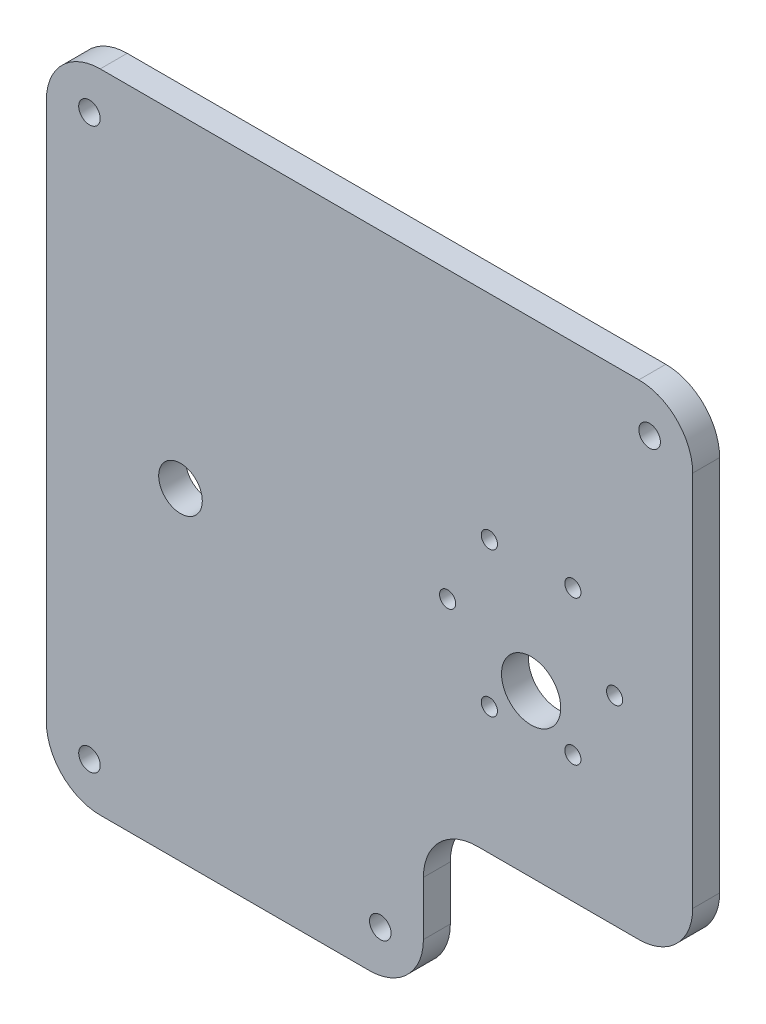
ISO-10303-21;
HEADER;
FILE_DESCRIPTION(('STEP AP214'),'2;1');
FILE_NAME('part.step','',(''),(''),'','','');
FILE_SCHEMA(('AUTOMOTIVE_DESIGN { 1 0 10303 214 1 1 1 1 }'));
ENDSEC;
DATA;
#1=APPLICATION_CONTEXT('core data for automotive mechanical design processes');
#2=APPLICATION_PROTOCOL_DEFINITION('international standard','automotive_design',2000,#1);
#3=PRODUCT_CONTEXT('',#1,'mechanical');
#4=PRODUCT('Part','Part','',(#3));
#5=PRODUCT_RELATED_PRODUCT_CATEGORY('part','',(#4));
#6=PRODUCT_DEFINITION_FORMATION('','',#4);
#7=PRODUCT_DEFINITION_CONTEXT('part definition',#1,'design');
#8=PRODUCT_DEFINITION('design','',#6,#7);
#9=PRODUCT_DEFINITION_SHAPE('','',#8);
#10=(LENGTH_UNIT() NAMED_UNIT(*) SI_UNIT(.MILLI.,.METRE.));
#11=(NAMED_UNIT(*) PLANE_ANGLE_UNIT() SI_UNIT($,.RADIAN.));
#12=(NAMED_UNIT(*) SI_UNIT($,.STERADIAN.) SOLID_ANGLE_UNIT());
#13=UNCERTAINTY_MEASURE_WITH_UNIT(LENGTH_MEASURE(1.E-05),#10,'distance_accuracy_value','');
#14=(GEOMETRIC_REPRESENTATION_CONTEXT(3) GLOBAL_UNCERTAINTY_ASSIGNED_CONTEXT((#13)) GLOBAL_UNIT_ASSIGNED_CONTEXT((#10,
#11,#12)) REPRESENTATION_CONTEXT('',''));
#15=CARTESIAN_POINT('',(0.,0.,0.));
#16=DIRECTION('',(0.,0.,1.));
#17=DIRECTION('',(1.,0.,0.));
#18=AXIS2_PLACEMENT_3D('',#15,#16,#17);
#19=CARTESIAN_POINT('',(60.,10.,5.));
#20=DIRECTION('',(0.,0.,-1.));
#21=DIRECTION('',(-1.,0.,0.));
#22=AXIS2_PLACEMENT_3D('',#19,#20,#21);
#23=CYLINDRICAL_SURFACE('',#22,10.);
#24=CARTESIAN_POINT('',(60.,10.,0.));
#25=DIRECTION('',(0.,0.,1.));
#26=DIRECTION('',(-1.,0.,0.));
#27=AXIS2_PLACEMENT_3D('',#24,#25,#26);
#28=CIRCLE('',#27,10.);
#29=CARTESIAN_POINT('',(59.9999999999999,0.,0.));
#30=VERTEX_POINT('',#29);
#31=CARTESIAN_POINT('',(70.,10.0000000000001,0.));
#32=VERTEX_POINT('',#31);
#33=EDGE_CURVE('E156',#30,#32,#28,.T.);
#34=ORIENTED_EDGE('',*,*,#33,.T.);
#35=DIRECTION('',(0.,0.,-1.));
#36=VECTOR('',#35,1.);
#37=CARTESIAN_POINT('',(70.,10.0000000000001,5.));
#38=LINE('',#37,#36);
#39=CARTESIAN_POINT('',(70.,10.0000000000001,5.));
#40=VERTEX_POINT('',#39);
#41=EDGE_CURVE('E11',#40,#32,#38,.T.);
#42=ORIENTED_EDGE('',*,*,#41,.F.);
#43=CARTESIAN_POINT('',(60.,10.,5.));
#44=DIRECTION('',(0.,0.,1.));
#45=DIRECTION('',(-1.,0.,0.));
#46=AXIS2_PLACEMENT_3D('',#43,#44,#45);
#47=CIRCLE('',#46,10.);
#48=CARTESIAN_POINT('',(59.9999999999999,0.,5.));
#49=VERTEX_POINT('',#48);
#50=EDGE_CURVE('E179',#49,#40,#47,.T.);
#51=ORIENTED_EDGE('',*,*,#50,.F.);
#52=DIRECTION('',(0.,0.,-1.));
#53=VECTOR('',#52,1.);
#54=CARTESIAN_POINT('',(59.9999999999999,0.,5.));
#55=LINE('',#54,#53);
#56=EDGE_CURVE('E152',#49,#30,#55,.T.);
#57=ORIENTED_EDGE('',*,*,#56,.T.);
#58=EDGE_LOOP('',(#34,#42,#51,#57));
#59=FACE_BOUND('',#58,.T.);
#60=ADVANCED_FACE('F34',(#59),#23,.T.);
#61=CARTESIAN_POINT('',(70.,19.9999999999999,5.));
#62=DIRECTION('',(-1.,0.,0.));
#63=DIRECTION('',(0.,0.,1.));
#64=AXIS2_PLACEMENT_3D('',#61,#62,#63);
#65=PLANE('',#64);
#66=DIRECTION('',(0.,1.,0.));
#67=VECTOR('',#66,1.);
#68=CARTESIAN_POINT('',(70.,19.9999999999999,0.));
#69=LINE('',#68,#67);
#70=CARTESIAN_POINT('',(70.,19.9999999999999,0.));
#71=VERTEX_POINT('',#70);
#72=EDGE_CURVE('E159',#32,#71,#69,.T.);
#73=ORIENTED_EDGE('',*,*,#72,.T.);
#74=DIRECTION('',(0.,0.,-1.));
#75=VECTOR('',#74,1.);
#76=CARTESIAN_POINT('',(70.,19.9999999999999,5.));
#77=LINE('',#76,#75);
#78=CARTESIAN_POINT('',(70.,19.9999999999999,5.));
#79=VERTEX_POINT('',#78);
#80=EDGE_CURVE('E43',#79,#71,#77,.T.);
#81=ORIENTED_EDGE('',*,*,#80,.F.);
#82=DIRECTION('',(0.,1.,0.));
#83=VECTOR('',#82,1.);
#84=CARTESIAN_POINT('',(70.,19.9999999999999,5.));
#85=LINE('',#84,#83);
#86=EDGE_CURVE('E107',#40,#79,#85,.T.);
#87=ORIENTED_EDGE('',*,*,#86,.F.);
#88=ORIENTED_EDGE('',*,*,#41,.T.);
#89=EDGE_LOOP('',(#73,#81,#87,#88));
#90=FACE_BOUND('',#89,.T.);
#91=ADVANCED_FACE('F290',(#90),#65,.F.);
#92=CARTESIAN_POINT('',(80.,20.,5.));
#93=DIRECTION('',(0.,0.,-1.));
#94=DIRECTION('',(-1.,0.,0.));
#95=AXIS2_PLACEMENT_3D('',#92,#93,#94);
#96=CYLINDRICAL_SURFACE('',#95,10.);
#97=CARTESIAN_POINT('',(80.,20.,0.));
#98=DIRECTION('',(0.,0.,-1.));
#99=DIRECTION('',(1.,0.,0.));
#100=AXIS2_PLACEMENT_3D('',#97,#98,#99);
#101=CIRCLE('',#100,10.);
#102=CARTESIAN_POINT('',(80.0000000000001,30.,0.));
#103=VERTEX_POINT('',#102);
#104=EDGE_CURVE('E162',#71,#103,#101,.T.);
#105=ORIENTED_EDGE('',*,*,#104,.T.);
#106=DIRECTION('',(0.,0.,-1.));
#107=VECTOR('',#106,1.);
#108=CARTESIAN_POINT('',(80.0000000000001,30.,5.));
#109=LINE('',#108,#107);
#110=CARTESIAN_POINT('',(80.0000000000001,30.,5.));
#111=VERTEX_POINT('',#110);
#112=EDGE_CURVE('E198',#111,#103,#109,.T.);
#113=ORIENTED_EDGE('',*,*,#112,.F.);
#114=CARTESIAN_POINT('',(80.,20.,5.));
#115=DIRECTION('',(0.,0.,-1.));
#116=DIRECTION('',(1.,0.,0.));
#117=AXIS2_PLACEMENT_3D('',#114,#115,#116);
#118=CIRCLE('',#117,10.);
#119=EDGE_CURVE('E250',#79,#111,#118,.T.);
#120=ORIENTED_EDGE('',*,*,#119,.F.);
#121=ORIENTED_EDGE('',*,*,#80,.T.);
#122=EDGE_LOOP('',(#105,#113,#120,#121));
#123=FACE_BOUND('',#122,.T.);
#124=ADVANCED_FACE('F294',(#123),#96,.F.);
#125=CARTESIAN_POINT('',(110.,30.,5.));
#126=DIRECTION('',(0.,1.,0.));
#127=DIRECTION('',(-1.,0.,0.));
#128=AXIS2_PLACEMENT_3D('',#125,#126,#127);
#129=PLANE('',#128);
#130=DIRECTION('',(1.,0.,0.));
#131=VECTOR('',#130,1.);
#132=CARTESIAN_POINT('',(110.,30.,0.));
#133=LINE('',#132,#131);
#134=CARTESIAN_POINT('',(110.,30.,0.));
#135=VERTEX_POINT('',#134);
#136=EDGE_CURVE('E164',#103,#135,#133,.T.);
#137=ORIENTED_EDGE('',*,*,#136,.T.);
#138=DIRECTION('',(0.,0.,-1.));
#139=VECTOR('',#138,1.);
#140=CARTESIAN_POINT('',(110.,30.,5.));
#141=LINE('',#140,#139);
#142=CARTESIAN_POINT('',(110.,30.,5.));
#143=VERTEX_POINT('',#142);
#144=EDGE_CURVE('E195',#143,#135,#141,.T.);
#145=ORIENTED_EDGE('',*,*,#144,.F.);
#146=DIRECTION('',(1.,0.,0.));
#147=VECTOR('',#146,1.);
#148=CARTESIAN_POINT('',(110.,30.,5.));
#149=LINE('',#148,#147);
#150=EDGE_CURVE('E252',#111,#143,#149,.T.);
#151=ORIENTED_EDGE('',*,*,#150,.F.);
#152=ORIENTED_EDGE('',*,*,#112,.T.);
#153=EDGE_LOOP('',(#137,#145,#151,#152));
#154=FACE_BOUND('',#153,.T.);
#155=ADVANCED_FACE('F298',(#154),#129,.F.);
#156=CARTESIAN_POINT('',(110.,40.,5.));
#157=DIRECTION('',(0.,0.,-1.));
#158=DIRECTION('',(-1.,0.,0.));
#159=AXIS2_PLACEMENT_3D('',#156,#157,#158);
#160=CYLINDRICAL_SURFACE('',#159,10.);
#161=CARTESIAN_POINT('',(110.,40.,0.));
#162=DIRECTION('',(0.,0.,1.));
#163=DIRECTION('',(1.,0.,0.));
#164=AXIS2_PLACEMENT_3D('',#161,#162,#163);
#165=CIRCLE('',#164,10.);
#166=CARTESIAN_POINT('',(120.,40.,0.));
#167=VERTEX_POINT('',#166);
#168=EDGE_CURVE('E166',#135,#167,#165,.T.);
#169=ORIENTED_EDGE('',*,*,#168,.T.);
#170=DIRECTION('',(0.,0.,-1.));
#171=VECTOR('',#170,1.);
#172=CARTESIAN_POINT('',(120.,40.,5.));
#173=LINE('',#172,#171);
#174=CARTESIAN_POINT('',(120.,40.,5.));
#175=VERTEX_POINT('',#174);
#176=EDGE_CURVE('E192',#175,#167,#173,.T.);
#177=ORIENTED_EDGE('',*,*,#176,.F.);
#178=CARTESIAN_POINT('',(110.,40.,5.));
#179=DIRECTION('',(0.,0.,1.));
#180=DIRECTION('',(1.,0.,0.));
#181=AXIS2_PLACEMENT_3D('',#178,#179,#180);
#182=CIRCLE('',#181,10.);
#183=EDGE_CURVE('E254',#143,#175,#182,.T.);
#184=ORIENTED_EDGE('',*,*,#183,.F.);
#185=ORIENTED_EDGE('',*,*,#144,.T.);
#186=EDGE_LOOP('',(#169,#177,#184,#185));
#187=FACE_BOUND('',#186,.T.);
#188=ADVANCED_FACE('F304',(#187),#160,.T.);
#189=CARTESIAN_POINT('',(120.,40.0000000000001,5.));
#190=DIRECTION('',(-1.,0.,0.));
#191=DIRECTION('',(0.,0.,1.));
#192=AXIS2_PLACEMENT_3D('',#189,#190,#191);
#193=PLANE('',#192);
#194=DIRECTION('',(0.,1.,0.));
#195=VECTOR('',#194,1.);
#196=CARTESIAN_POINT('',(120.,40.0000000000001,0.));
#197=LINE('',#196,#195);
#198=CARTESIAN_POINT('',(120.,110.,0.));
#199=VERTEX_POINT('',#198);
#200=EDGE_CURVE('E168',#167,#199,#197,.T.);
#201=ORIENTED_EDGE('',*,*,#200,.T.);
#202=DIRECTION('',(0.,0.,-1.));
#203=VECTOR('',#202,1.);
#204=CARTESIAN_POINT('',(120.,110.,5.));
#205=LINE('',#204,#203);
#206=CARTESIAN_POINT('',(120.,110.,5.));
#207=VERTEX_POINT('',#206);
#208=EDGE_CURVE('E189',#207,#199,#205,.T.);
#209=ORIENTED_EDGE('',*,*,#208,.F.);
#210=DIRECTION('',(0.,1.,0.));
#211=VECTOR('',#210,1.);
#212=CARTESIAN_POINT('',(120.,40.0000000000001,5.));
#213=LINE('',#212,#211);
#214=EDGE_CURVE('E256',#175,#207,#213,.T.);
#215=ORIENTED_EDGE('',*,*,#214,.F.);
#216=ORIENTED_EDGE('',*,*,#176,.T.);
#217=EDGE_LOOP('',(#201,#209,#215,#216));
#218=FACE_BOUND('',#217,.T.);
#219=ADVANCED_FACE('F308',(#218),#193,.F.);
#220=CARTESIAN_POINT('',(110.,110.,5.));
#221=DIRECTION('',(0.,0.,-1.));
#222=DIRECTION('',(-1.,0.,0.));
#223=AXIS2_PLACEMENT_3D('',#220,#221,#222);
#224=CYLINDRICAL_SURFACE('',#223,9.99999999999999);
#225=CARTESIAN_POINT('',(110.,110.,0.));
#226=DIRECTION('',(0.,0.,1.));
#227=DIRECTION('',(-1.,0.,0.));
#228=AXIS2_PLACEMENT_3D('',#225,#226,#227);
#229=CIRCLE('',#228,9.99999999999999);
#230=CARTESIAN_POINT('',(110.,120.,0.));
#231=VERTEX_POINT('',#230);
#232=EDGE_CURVE('E170',#199,#231,#229,.T.);
#233=ORIENTED_EDGE('',*,*,#232,.T.);
#234=DIRECTION('',(0.,0.,-1.));
#235=VECTOR('',#234,1.);
#236=CARTESIAN_POINT('',(110.,120.,5.));
#237=LINE('',#236,#235);
#238=CARTESIAN_POINT('',(110.,120.,5.));
#239=VERTEX_POINT('',#238);
#240=EDGE_CURVE('E186',#239,#231,#237,.T.);
#241=ORIENTED_EDGE('',*,*,#240,.F.);
#242=CARTESIAN_POINT('',(110.,110.,5.));
#243=DIRECTION('',(0.,0.,1.));
#244=DIRECTION('',(-1.,0.,0.));
#245=AXIS2_PLACEMENT_3D('',#242,#243,#244);
#246=CIRCLE('',#245,9.99999999999999);
#247=EDGE_CURVE('E258',#207,#239,#246,.T.);
#248=ORIENTED_EDGE('',*,*,#247,.F.);
#249=ORIENTED_EDGE('',*,*,#208,.T.);
#250=EDGE_LOOP('',(#233,#241,#248,#249));
#251=FACE_BOUND('',#250,.T.);
#252=ADVANCED_FACE('F312',(#251),#224,.T.);
#253=CARTESIAN_POINT('',(10.0000000000001,120.,5.));
#254=DIRECTION('',(0.,-1.,0.));
#255=DIRECTION('',(0.,0.,-1.));
#256=AXIS2_PLACEMENT_3D('',#253,#254,#255);
#257=PLANE('',#256);
#258=DIRECTION('',(-1.,0.,0.));
#259=VECTOR('',#258,1.);
#260=CARTESIAN_POINT('',(10.0000000000001,120.,0.));
#261=LINE('',#260,#259);
#262=CARTESIAN_POINT('',(10.0000000000001,120.,0.));
#263=VERTEX_POINT('',#262);
#264=EDGE_CURVE('E172',#231,#263,#261,.T.);
#265=ORIENTED_EDGE('',*,*,#264,.T.);
#266=DIRECTION('',(0.,0.,-1.));
#267=VECTOR('',#266,1.);
#268=CARTESIAN_POINT('',(10.0000000000001,120.,5.));
#269=LINE('',#268,#267);
#270=CARTESIAN_POINT('',(10.0000000000001,120.,5.));
#271=VERTEX_POINT('',#270);
#272=EDGE_CURVE('E183',#271,#263,#269,.T.);
#273=ORIENTED_EDGE('',*,*,#272,.F.);
#274=DIRECTION('',(-1.,0.,0.));
#275=VECTOR('',#274,1.);
#276=CARTESIAN_POINT('',(10.0000000000001,120.,5.));
#277=LINE('',#276,#275);
#278=EDGE_CURVE('E260',#239,#271,#277,.T.);
#279=ORIENTED_EDGE('',*,*,#278,.F.);
#280=ORIENTED_EDGE('',*,*,#240,.T.);
#281=EDGE_LOOP('',(#265,#273,#279,#280));
#282=FACE_BOUND('',#281,.T.);
#283=ADVANCED_FACE('F266',(#282),#257,.F.);
#284=CARTESIAN_POINT('',(10.,110.,5.));
#285=DIRECTION('',(0.,0.,-1.));
#286=DIRECTION('',(-1.,0.,0.));
#287=AXIS2_PLACEMENT_3D('',#284,#285,#286);
#288=CYLINDRICAL_SURFACE('',#287,10.);
#289=CARTESIAN_POINT('',(10.,110.,0.));
#290=DIRECTION('',(0.,0.,1.));
#291=DIRECTION('',(-1.,0.,0.));
#292=AXIS2_PLACEMENT_3D('',#289,#290,#291);
#293=CIRCLE('',#292,10.);
#294=CARTESIAN_POINT('',(0.,110.,0.));
#295=VERTEX_POINT('',#294);
#296=EDGE_CURVE('E174',#263,#295,#293,.T.);
#297=ORIENTED_EDGE('',*,*,#296,.T.);
#298=DIRECTION('',(0.,0.,-1.));
#299=VECTOR('',#298,1.);
#300=CARTESIAN_POINT('',(0.,110.,5.));
#301=LINE('',#300,#299);
#302=CARTESIAN_POINT('',(0.,110.,5.));
#303=VERTEX_POINT('',#302);
#304=EDGE_CURVE('E147',#303,#295,#301,.T.);
#305=ORIENTED_EDGE('',*,*,#304,.F.);
#306=CARTESIAN_POINT('',(10.,110.,5.));
#307=DIRECTION('',(0.,0.,1.));
#308=DIRECTION('',(-1.,0.,0.));
#309=AXIS2_PLACEMENT_3D('',#306,#307,#308);
#310=CIRCLE('',#309,10.);
#311=EDGE_CURVE('E138',#271,#303,#310,.T.);
#312=ORIENTED_EDGE('',*,*,#311,.F.);
#313=ORIENTED_EDGE('',*,*,#272,.T.);
#314=EDGE_LOOP('',(#297,#305,#312,#313));
#315=FACE_BOUND('',#314,.T.);
#316=ADVANCED_FACE('F270',(#315),#288,.T.);
#317=CARTESIAN_POINT('',(0.,10.0000000000001,5.));
#318=DIRECTION('',(1.,0.,0.));
#319=DIRECTION('',(0.,0.,-1.));
#320=AXIS2_PLACEMENT_3D('',#317,#318,#319);
#321=PLANE('',#320);
#322=DIRECTION('',(0.,-1.,0.));
#323=VECTOR('',#322,1.);
#324=CARTESIAN_POINT('',(0.,10.0000000000001,0.));
#325=LINE('',#324,#323);
#326=CARTESIAN_POINT('',(0.,10.0000000000001,0.));
#327=VERTEX_POINT('',#326);
#328=EDGE_CURVE('E146',#295,#327,#325,.T.);
#329=ORIENTED_EDGE('',*,*,#328,.T.);
#330=DIRECTION('',(0.,0.,-1.));
#331=VECTOR('',#330,1.);
#332=CARTESIAN_POINT('',(0.,10.0000000000001,5.));
#333=LINE('',#332,#331);
#334=CARTESIAN_POINT('',(0.,10.0000000000001,5.));
#335=VERTEX_POINT('',#334);
#336=EDGE_CURVE('E143',#335,#327,#333,.T.);
#337=ORIENTED_EDGE('',*,*,#336,.F.);
#338=DIRECTION('',(0.,-1.,0.));
#339=VECTOR('',#338,1.);
#340=CARTESIAN_POINT('',(0.,10.0000000000001,5.));
#341=LINE('',#340,#339);
#342=EDGE_CURVE('E132',#303,#335,#341,.T.);
#343=ORIENTED_EDGE('',*,*,#342,.F.);
#344=ORIENTED_EDGE('',*,*,#304,.T.);
#345=EDGE_LOOP('',(#329,#337,#343,#344));
#346=FACE_BOUND('',#345,.T.);
#347=ADVANCED_FACE('F144',(#346),#321,.F.);
#348=CARTESIAN_POINT('',(10.,10.,5.));
#349=DIRECTION('',(0.,0.,-1.));
#350=DIRECTION('',(-1.,0.,0.));
#351=AXIS2_PLACEMENT_3D('',#348,#349,#350);
#352=CYLINDRICAL_SURFACE('',#351,10.);
#353=CARTESIAN_POINT('',(10.,10.,0.));
#354=DIRECTION('',(0.,0.,1.));
#355=DIRECTION('',(-1.,0.,0.));
#356=AXIS2_PLACEMENT_3D('',#353,#354,#355);
#357=CIRCLE('',#356,10.);
#358=CARTESIAN_POINT('',(10.0000000000001,0.,0.));
#359=VERTEX_POINT('',#358);
#360=EDGE_CURVE('E93',#327,#359,#357,.T.);
#361=ORIENTED_EDGE('',*,*,#360,.T.);
#362=DIRECTION('',(0.,0.,-1.));
#363=VECTOR('',#362,1.);
#364=CARTESIAN_POINT('',(10.0000000000001,0.,5.));
#365=LINE('',#364,#363);
#366=CARTESIAN_POINT('',(10.0000000000001,0.,5.));
#367=VERTEX_POINT('',#366);
#368=EDGE_CURVE('E148',#367,#359,#365,.T.);
#369=ORIENTED_EDGE('',*,*,#368,.F.);
#370=CARTESIAN_POINT('',(10.,10.,5.));
#371=DIRECTION('',(0.,0.,1.));
#372=DIRECTION('',(-1.,0.,0.));
#373=AXIS2_PLACEMENT_3D('',#370,#371,#372);
#374=CIRCLE('',#373,10.);
#375=EDGE_CURVE('E136',#335,#367,#374,.T.);
#376=ORIENTED_EDGE('',*,*,#375,.F.);
#377=ORIENTED_EDGE('',*,*,#336,.T.);
#378=EDGE_LOOP('',(#361,#369,#376,#377));
#379=FACE_BOUND('',#378,.T.);
#380=ADVANCED_FACE('F150',(#379),#352,.T.);
#381=CARTESIAN_POINT('',(10.0000000000001,0.,5.));
#382=DIRECTION('',(0.,1.,0.));
#383=DIRECTION('',(-1.,0.,0.));
#384=AXIS2_PLACEMENT_3D('',#381,#382,#383);
#385=PLANE('',#384);
#386=DIRECTION('',(1.,0.,0.));
#387=VECTOR('',#386,1.);
#388=CARTESIAN_POINT('',(10.0000000000001,0.,0.));
#389=LINE('',#388,#387);
#390=EDGE_CURVE('E99',#359,#30,#389,.T.);
#391=ORIENTED_EDGE('',*,*,#390,.T.);
#392=ORIENTED_EDGE('',*,*,#56,.F.);
#393=DIRECTION('',(1.,0.,0.));
#394=VECTOR('',#393,1.);
#395=CARTESIAN_POINT('',(10.0000000000001,0.,5.));
#396=LINE('',#395,#394);
#397=EDGE_CURVE('E52',#367,#49,#396,.T.);
#398=ORIENTED_EDGE('',*,*,#397,.F.);
#399=ORIENTED_EDGE('',*,*,#368,.T.);
#400=EDGE_LOOP('',(#391,#392,#398,#399));
#401=FACE_BOUND('',#400,.T.);
#402=ADVANCED_FACE('F278',(#401),#385,.F.);
#403=CARTESIAN_POINT('',(60.,10.,5.));
#404=DIRECTION('',(0.,0.,-1.));
#405=DIRECTION('',(-1.,0.,0.));
#406=AXIS2_PLACEMENT_3D('',#403,#404,#405);
#407=PLANE('',#406);
#408=CARTESIAN_POINT('',(82.25,53.5766062413412,5.));
#409=DIRECTION('',(0.,0.,1.));
#410=DIRECTION('',(1.,0.,0.));
#411=AXIS2_PLACEMENT_3D('',#408,#409,#410);
#412=CIRCLE('',#411,1.5);
#413=CARTESIAN_POINT('',(83.75,53.5766062413412,5.));
#414=VERTEX_POINT('',#413);
#415=EDGE_CURVE('E473',#414,#414,#412,.T.);
#416=ORIENTED_EDGE('',*,*,#415,.F.);
#417=EDGE_LOOP('',(#416));
#418=FACE_BOUND('',#417,.T.);
#419=CARTESIAN_POINT('',(74.5,67.,5.));
#420=DIRECTION('',(0.,0.,1.));
#421=DIRECTION('',(1.,0.,0.));
#422=AXIS2_PLACEMENT_3D('',#419,#420,#421);
#423=CIRCLE('',#422,1.5);
#424=CARTESIAN_POINT('',(76.,67.,5.));
#425=VERTEX_POINT('',#424);
#426=EDGE_CURVE('E475',#425,#425,#423,.T.);
#427=ORIENTED_EDGE('',*,*,#426,.F.);
#428=EDGE_LOOP('',(#427));
#429=FACE_BOUND('',#428,.T.);
#430=CARTESIAN_POINT('',(90.,60.,5.));
#431=DIRECTION('',(0.,0.,1.));
#432=DIRECTION('',(1.,0.,0.));
#433=AXIS2_PLACEMENT_3D('',#430,#431,#432);
#434=CIRCLE('',#433,5.5);
#435=CARTESIAN_POINT('',(95.5,60.,5.));
#436=VERTEX_POINT('',#435);
#437=EDGE_CURVE('E481',#436,#436,#434,.T.);
#438=ORIENTED_EDGE('',*,*,#437,.F.);
#439=EDGE_LOOP('',(#438));
#440=FACE_BOUND('',#439,.T.);
#441=CARTESIAN_POINT('',(97.75,53.5766062413412,5.));
#442=DIRECTION('',(0.,0.,1.));
#443=DIRECTION('',(1.,0.,0.));
#444=AXIS2_PLACEMENT_3D('',#441,#442,#443);
#445=CIRCLE('',#444,1.5);
#446=CARTESIAN_POINT('',(99.25,53.5766062413412,5.));
#447=VERTEX_POINT('',#446);
#448=EDGE_CURVE('E474',#447,#447,#445,.T.);
#449=ORIENTED_EDGE('',*,*,#448,.F.);
#450=EDGE_LOOP('',(#449));
#451=FACE_BOUND('',#450,.T.);
#452=CARTESIAN_POINT('',(105.5,67.,5.));
#453=DIRECTION('',(0.,0.,1.));
#454=DIRECTION('',(1.,0.,0.));
#455=AXIS2_PLACEMENT_3D('',#452,#453,#454);
#456=CIRCLE('',#455,1.5);
#457=CARTESIAN_POINT('',(107.,67.,5.));
#458=VERTEX_POINT('',#457);
#459=EDGE_CURVE('E478',#458,#458,#456,.T.);
#460=ORIENTED_EDGE('',*,*,#459,.F.);
#461=EDGE_LOOP('',(#460));
#462=FACE_BOUND('',#461,.T.);
#463=CARTESIAN_POINT('',(97.75,80.4233937586588,5.));
#464=DIRECTION('',(0.,0.,1.));
#465=DIRECTION('',(1.,0.,0.));
#466=AXIS2_PLACEMENT_3D('',#463,#464,#465);
#467=CIRCLE('',#466,1.5);
#468=CARTESIAN_POINT('',(99.25,80.4233937586588,5.));
#469=VERTEX_POINT('',#468);
#470=EDGE_CURVE('E493',#469,#469,#467,.T.);
#471=ORIENTED_EDGE('',*,*,#470,.F.);
#472=EDGE_LOOP('',(#471));
#473=FACE_BOUND('',#472,.T.);
#474=CARTESIAN_POINT('',(8.,8.00000000000002,5.));
#475=DIRECTION('',(0.,0.,1.));
#476=DIRECTION('',(-1.,0.,0.));
#477=AXIS2_PLACEMENT_3D('',#474,#475,#476);
#478=CIRCLE('',#477,2.);
#479=CARTESIAN_POINT('',(6.,8.00000000000002,5.));
#480=VERTEX_POINT('',#479);
#481=EDGE_CURVE('E210',#480,#480,#478,.T.);
#482=ORIENTED_EDGE('',*,*,#481,.F.);
#483=EDGE_LOOP('',(#482));
#484=FACE_BOUND('',#483,.T.);
#485=CARTESIAN_POINT('',(112.,112.,5.));
#486=DIRECTION('',(0.,0.,1.));
#487=DIRECTION('',(-1.,0.,0.));
#488=AXIS2_PLACEMENT_3D('',#485,#486,#487);
#489=CIRCLE('',#488,2.00000000000001);
#490=CARTESIAN_POINT('',(110.,112.,5.));
#491=VERTEX_POINT('',#490);
#492=EDGE_CURVE('E246',#491,#491,#489,.T.);
#493=ORIENTED_EDGE('',*,*,#492,.F.);
#494=EDGE_LOOP('',(#493));
#495=FACE_BOUND('',#494,.T.);
#496=CARTESIAN_POINT('',(62.,8.00000000000002,5.));
#497=DIRECTION('',(0.,0.,1.));
#498=DIRECTION('',(1.,0.,0.));
#499=AXIS2_PLACEMENT_3D('',#496,#497,#498);
#500=CIRCLE('',#499,1.99999999999999);
#501=CARTESIAN_POINT('',(64.,8.00000000000002,5.));
#502=VERTEX_POINT('',#501);
#503=EDGE_CURVE('E485',#502,#502,#500,.T.);
#504=ORIENTED_EDGE('',*,*,#503,.F.);
#505=EDGE_LOOP('',(#504));
#506=FACE_BOUND('',#505,.T.);
#507=CARTESIAN_POINT('',(24.9,60.,5.));
#508=DIRECTION('',(0.,0.,1.));
#509=DIRECTION('',(1.,0.,0.));
#510=AXIS2_PLACEMENT_3D('',#507,#508,#509);
#511=CIRCLE('',#510,4.05);
#512=CARTESIAN_POINT('',(28.95,60.,5.));
#513=VERTEX_POINT('',#512);
#514=EDGE_CURVE('E488',#513,#513,#511,.T.);
#515=ORIENTED_EDGE('',*,*,#514,.F.);
#516=EDGE_LOOP('',(#515));
#517=FACE_BOUND('',#516,.T.);
#518=CARTESIAN_POINT('',(82.25,80.4233937586588,5.));
#519=DIRECTION('',(0.,0.,1.));
#520=DIRECTION('',(1.,0.,0.));
#521=AXIS2_PLACEMENT_3D('',#518,#519,#520);
#522=CIRCLE('',#521,1.5);
#523=CARTESIAN_POINT('',(83.75,80.4233937586588,5.));
#524=VERTEX_POINT('',#523);
#525=EDGE_CURVE('E491',#524,#524,#522,.T.);
#526=ORIENTED_EDGE('',*,*,#525,.F.);
#527=EDGE_LOOP('',(#526));
#528=FACE_BOUND('',#527,.T.);
#529=CARTESIAN_POINT('',(8.,112.,5.));
#530=DIRECTION('',(0.,0.,1.));
#531=DIRECTION('',(1.,0.,0.));
#532=AXIS2_PLACEMENT_3D('',#529,#530,#531);
#533=CIRCLE('',#532,2.);
#534=CARTESIAN_POINT('',(10.,112.,5.));
#535=VERTEX_POINT('',#534);
#536=EDGE_CURVE('E205',#535,#535,#533,.T.);
#537=ORIENTED_EDGE('',*,*,#536,.F.);
#538=EDGE_LOOP('',(#537));
#539=FACE_BOUND('',#538,.T.);
#540=ORIENTED_EDGE('',*,*,#50,.T.);
#541=ORIENTED_EDGE('',*,*,#86,.T.);
#542=ORIENTED_EDGE('',*,*,#119,.T.);
#543=ORIENTED_EDGE('',*,*,#150,.T.);
#544=ORIENTED_EDGE('',*,*,#183,.T.);
#545=ORIENTED_EDGE('',*,*,#214,.T.);
#546=ORIENTED_EDGE('',*,*,#247,.T.);
#547=ORIENTED_EDGE('',*,*,#278,.T.);
#548=ORIENTED_EDGE('',*,*,#311,.T.);
#549=ORIENTED_EDGE('',*,*,#342,.T.);
#550=ORIENTED_EDGE('',*,*,#375,.T.);
#551=ORIENTED_EDGE('',*,*,#397,.T.);
#552=EDGE_LOOP('',(#540,#541,#542,#543,#544,#545,#546,#547,#548,#549,#550,#551));
#553=FACE_BOUND('',#552,.T.);
#554=ADVANCED_FACE('F134',(#418,#429,#440,#451,#462,#473,#484,#495,#506,#517,#528,#539,#553),
#407,.F.);
#555=CARTESIAN_POINT('',(60.,10.,0.));
#556=DIRECTION('',(0.,0.,-1.));
#557=DIRECTION('',(-1.,0.,0.));
#558=AXIS2_PLACEMENT_3D('',#555,#556,#557);
#559=PLANE('',#558);
#560=CARTESIAN_POINT('',(82.25,53.5766062413412,0.));
#561=DIRECTION('',(0.,0.,-1.));
#562=DIRECTION('',(-1.,0.,0.));
#563=AXIS2_PLACEMENT_3D('',#560,#561,#562);
#564=CIRCLE('',#563,1.5);
#565=CARTESIAN_POINT('',(80.75,53.5766062413412,0.));
#566=VERTEX_POINT('',#565);
#567=EDGE_CURVE('E37',#566,#566,#564,.T.);
#568=ORIENTED_EDGE('',*,*,#567,.F.);
#569=EDGE_LOOP('',(#568));
#570=FACE_BOUND('',#569,.T.);
#571=CARTESIAN_POINT('',(74.5,67.,0.));
#572=DIRECTION('',(0.,0.,-1.));
#573=DIRECTION('',(-1.,0.,0.));
#574=AXIS2_PLACEMENT_3D('',#571,#572,#573);
#575=CIRCLE('',#574,1.5);
#576=CARTESIAN_POINT('',(73.,67.,0.));
#577=VERTEX_POINT('',#576);
#578=EDGE_CURVE('E233',#577,#577,#575,.T.);
#579=ORIENTED_EDGE('',*,*,#578,.F.);
#580=EDGE_LOOP('',(#579));
#581=FACE_BOUND('',#580,.T.);
#582=CARTESIAN_POINT('',(90.,60.,0.));
#583=DIRECTION('',(0.,0.,-1.));
#584=DIRECTION('',(-1.,0.,0.));
#585=AXIS2_PLACEMENT_3D('',#582,#583,#584);
#586=CIRCLE('',#585,5.5);
#587=CARTESIAN_POINT('',(84.5,60.,0.));
#588=VERTEX_POINT('',#587);
#589=EDGE_CURVE('E231',#588,#588,#586,.T.);
#590=ORIENTED_EDGE('',*,*,#589,.F.);
#591=EDGE_LOOP('',(#590));
#592=FACE_BOUND('',#591,.T.);
#593=CARTESIAN_POINT('',(97.75,53.5766062413412,0.));
#594=DIRECTION('',(0.,0.,-1.));
#595=DIRECTION('',(-1.,0.,0.));
#596=AXIS2_PLACEMENT_3D('',#593,#594,#595);
#597=CIRCLE('',#596,1.5);
#598=CARTESIAN_POINT('',(96.25,53.5766062413412,0.));
#599=VERTEX_POINT('',#598);
#600=EDGE_CURVE('E228',#599,#599,#597,.T.);
#601=ORIENTED_EDGE('',*,*,#600,.F.);
#602=EDGE_LOOP('',(#601));
#603=FACE_BOUND('',#602,.T.);
#604=CARTESIAN_POINT('',(105.5,67.,0.));
#605=DIRECTION('',(0.,0.,-1.));
#606=DIRECTION('',(-1.,0.,0.));
#607=AXIS2_PLACEMENT_3D('',#604,#605,#606);
#608=CIRCLE('',#607,1.5);
#609=CARTESIAN_POINT('',(104.,67.,0.));
#610=VERTEX_POINT('',#609);
#611=EDGE_CURVE('E225',#610,#610,#608,.T.);
#612=ORIENTED_EDGE('',*,*,#611,.F.);
#613=EDGE_LOOP('',(#612));
#614=FACE_BOUND('',#613,.T.);
#615=CARTESIAN_POINT('',(97.75,80.4233937586588,0.));
#616=DIRECTION('',(0.,0.,-1.));
#617=DIRECTION('',(-1.,0.,0.));
#618=AXIS2_PLACEMENT_3D('',#615,#616,#617);
#619=CIRCLE('',#618,1.5);
#620=CARTESIAN_POINT('',(96.25,80.4233937586588,0.));
#621=VERTEX_POINT('',#620);
#622=EDGE_CURVE('E222',#621,#621,#619,.T.);
#623=ORIENTED_EDGE('',*,*,#622,.F.);
#624=EDGE_LOOP('',(#623));
#625=FACE_BOUND('',#624,.T.);
#626=CARTESIAN_POINT('',(8.,8.00000000000002,0.));
#627=DIRECTION('',(0.,0.,-1.));
#628=DIRECTION('',(-1.,0.,0.));
#629=AXIS2_PLACEMENT_3D('',#626,#627,#628);
#630=CIRCLE('',#629,2.);
#631=CARTESIAN_POINT('',(6.,8.00000000000002,0.));
#632=VERTEX_POINT('',#631);
#633=EDGE_CURVE('E219',#632,#632,#630,.T.);
#634=ORIENTED_EDGE('',*,*,#633,.F.);
#635=EDGE_LOOP('',(#634));
#636=FACE_BOUND('',#635,.T.);
#637=CARTESIAN_POINT('',(112.,112.,0.));
#638=DIRECTION('',(0.,0.,-1.));
#639=DIRECTION('',(-1.,0.,0.));
#640=AXIS2_PLACEMENT_3D('',#637,#638,#639);
#641=CIRCLE('',#640,2.00000000000001);
#642=CARTESIAN_POINT('',(110.,112.,0.));
#643=VERTEX_POINT('',#642);
#644=EDGE_CURVE('E216',#643,#643,#641,.T.);
#645=ORIENTED_EDGE('',*,*,#644,.F.);
#646=EDGE_LOOP('',(#645));
#647=FACE_BOUND('',#646,.T.);
#648=CARTESIAN_POINT('',(62.,8.00000000000002,0.));
#649=DIRECTION('',(0.,0.,-1.));
#650=DIRECTION('',(-1.,0.,0.));
#651=AXIS2_PLACEMENT_3D('',#648,#649,#650);
#652=CIRCLE('',#651,1.99999999999999);
#653=CARTESIAN_POINT('',(60.,8.00000000000002,0.));
#654=VERTEX_POINT('',#653);
#655=EDGE_CURVE('E213',#654,#654,#652,.T.);
#656=ORIENTED_EDGE('',*,*,#655,.F.);
#657=EDGE_LOOP('',(#656));
#658=FACE_BOUND('',#657,.T.);
#659=CARTESIAN_POINT('',(24.9,60.,0.));
#660=DIRECTION('',(0.,0.,-1.));
#661=DIRECTION('',(-1.,0.,0.));
#662=AXIS2_PLACEMENT_3D('',#659,#660,#661);
#663=CIRCLE('',#662,4.05);
#664=CARTESIAN_POINT('',(20.85,60.,0.));
#665=VERTEX_POINT('',#664);
#666=EDGE_CURVE('E209',#665,#665,#663,.T.);
#667=ORIENTED_EDGE('',*,*,#666,.F.);
#668=EDGE_LOOP('',(#667));
#669=FACE_BOUND('',#668,.T.);
#670=CARTESIAN_POINT('',(82.25,80.4233937586588,0.));
#671=DIRECTION('',(0.,0.,-1.));
#672=DIRECTION('',(-1.,0.,0.));
#673=AXIS2_PLACEMENT_3D('',#670,#671,#672);
#674=CIRCLE('',#673,1.5);
#675=CARTESIAN_POINT('',(80.75,80.4233937586588,0.));
#676=VERTEX_POINT('',#675);
#677=EDGE_CURVE('E206',#676,#676,#674,.T.);
#678=ORIENTED_EDGE('',*,*,#677,.F.);
#679=EDGE_LOOP('',(#678));
#680=FACE_BOUND('',#679,.T.);
#681=CARTESIAN_POINT('',(8.,112.,0.));
#682=DIRECTION('',(0.,0.,-1.));
#683=DIRECTION('',(-1.,0.,0.));
#684=AXIS2_PLACEMENT_3D('',#681,#682,#683);
#685=CIRCLE('',#684,2.);
#686=CARTESIAN_POINT('',(6.,112.,0.));
#687=VERTEX_POINT('',#686);
#688=EDGE_CURVE('E160',#687,#687,#685,.T.);
#689=ORIENTED_EDGE('',*,*,#688,.F.);
#690=EDGE_LOOP('',(#689));
#691=FACE_BOUND('',#690,.T.);
#692=ORIENTED_EDGE('',*,*,#33,.F.);
#693=ORIENTED_EDGE('',*,*,#390,.F.);
#694=ORIENTED_EDGE('',*,*,#360,.F.);
#695=ORIENTED_EDGE('',*,*,#328,.F.);
#696=ORIENTED_EDGE('',*,*,#296,.F.);
#697=ORIENTED_EDGE('',*,*,#264,.F.);
#698=ORIENTED_EDGE('',*,*,#232,.F.);
#699=ORIENTED_EDGE('',*,*,#200,.F.);
#700=ORIENTED_EDGE('',*,*,#168,.F.);
#701=ORIENTED_EDGE('',*,*,#136,.F.);
#702=ORIENTED_EDGE('',*,*,#104,.F.);
#703=ORIENTED_EDGE('',*,*,#72,.F.);
#704=EDGE_LOOP('',(#692,#693,#694,#695,#696,#697,#698,#699,#700,#701,#702,#703));
#705=FACE_BOUND('',#704,.T.);
#706=ADVANCED_FACE('F273',(#570,#581,#592,#603,#614,#625,#636,#647,#658,#669,#680,#691,#705),
#559,.T.);
#707=CARTESIAN_POINT('',(8.,112.,-5.));
#708=DIRECTION('',(0.,0.,1.));
#709=DIRECTION('',(1.,0.,0.));
#710=AXIS2_PLACEMENT_3D('',#707,#708,#709);
#711=CYLINDRICAL_SURFACE('',#710,2.);
#712=ORIENTED_EDGE('',*,*,#688,.T.);
#713=EDGE_LOOP('',(#712));
#714=FACE_BOUND('',#713,.T.);
#715=ORIENTED_EDGE('',*,*,#536,.T.);
#716=EDGE_LOOP('',(#715));
#717=FACE_BOUND('',#716,.T.);
#718=ADVANCED_FACE('F349',(#714,#717),#711,.F.);
#719=CARTESIAN_POINT('',(82.25,80.4233937586588,-5.));
#720=DIRECTION('',(0.,0.,1.));
#721=DIRECTION('',(1.,0.,0.));
#722=AXIS2_PLACEMENT_3D('',#719,#720,#721);
#723=CYLINDRICAL_SURFACE('',#722,1.5);
#724=ORIENTED_EDGE('',*,*,#677,.T.);
#725=EDGE_LOOP('',(#724));
#726=FACE_BOUND('',#725,.T.);
#727=ORIENTED_EDGE('',*,*,#525,.T.);
#728=EDGE_LOOP('',(#727));
#729=FACE_BOUND('',#728,.T.);
#730=ADVANCED_FACE('F358',(#726,#729),#723,.F.);
#731=CARTESIAN_POINT('',(24.9,60.,-5.));
#732=DIRECTION('',(0.,0.,1.));
#733=DIRECTION('',(1.,0.,0.));
#734=AXIS2_PLACEMENT_3D('',#731,#732,#733);
#735=CYLINDRICAL_SURFACE('',#734,4.05);
#736=ORIENTED_EDGE('',*,*,#666,.T.);
#737=EDGE_LOOP('',(#736));
#738=FACE_BOUND('',#737,.T.);
#739=ORIENTED_EDGE('',*,*,#514,.T.);
#740=EDGE_LOOP('',(#739));
#741=FACE_BOUND('',#740,.T.);
#742=ADVANCED_FACE('F368',(#738,#741),#735,.F.);
#743=CARTESIAN_POINT('',(62.,8.00000000000002,-5.));
#744=DIRECTION('',(0.,0.,1.));
#745=DIRECTION('',(1.,0.,0.));
#746=AXIS2_PLACEMENT_3D('',#743,#744,#745);
#747=CYLINDRICAL_SURFACE('',#746,1.99999999999999);
#748=ORIENTED_EDGE('',*,*,#655,.T.);
#749=EDGE_LOOP('',(#748));
#750=FACE_BOUND('',#749,.T.);
#751=ORIENTED_EDGE('',*,*,#503,.T.);
#752=EDGE_LOOP('',(#751));
#753=FACE_BOUND('',#752,.T.);
#754=ADVANCED_FACE('F378',(#750,#753),#747,.F.);
#755=CARTESIAN_POINT('',(112.,112.,-5.));
#756=DIRECTION('',(0.,0.,1.));
#757=DIRECTION('',(1.,0.,0.));
#758=AXIS2_PLACEMENT_3D('',#755,#756,#757);
#759=CYLINDRICAL_SURFACE('',#758,2.00000000000001);
#760=ORIENTED_EDGE('',*,*,#644,.T.);
#761=EDGE_LOOP('',(#760));
#762=FACE_BOUND('',#761,.T.);
#763=ORIENTED_EDGE('',*,*,#492,.T.);
#764=EDGE_LOOP('',(#763));
#765=FACE_BOUND('',#764,.T.);
#766=ADVANCED_FACE('F388',(#762,#765),#759,.F.);
#767=CARTESIAN_POINT('',(8.,8.00000000000002,-5.));
#768=DIRECTION('',(0.,0.,1.));
#769=DIRECTION('',(1.,0.,0.));
#770=AXIS2_PLACEMENT_3D('',#767,#768,#769);
#771=CYLINDRICAL_SURFACE('',#770,2.);
#772=ORIENTED_EDGE('',*,*,#633,.T.);
#773=EDGE_LOOP('',(#772));
#774=FACE_BOUND('',#773,.T.);
#775=ORIENTED_EDGE('',*,*,#481,.T.);
#776=EDGE_LOOP('',(#775));
#777=FACE_BOUND('',#776,.T.);
#778=ADVANCED_FACE('F398',(#774,#777),#771,.F.);
#779=CARTESIAN_POINT('',(97.75,80.4233937586588,-5.));
#780=DIRECTION('',(0.,0.,1.));
#781=DIRECTION('',(1.,0.,0.));
#782=AXIS2_PLACEMENT_3D('',#779,#780,#781);
#783=CYLINDRICAL_SURFACE('',#782,1.5);
#784=ORIENTED_EDGE('',*,*,#622,.T.);
#785=EDGE_LOOP('',(#784));
#786=FACE_BOUND('',#785,.T.);
#787=ORIENTED_EDGE('',*,*,#470,.T.);
#788=EDGE_LOOP('',(#787));
#789=FACE_BOUND('',#788,.T.);
#790=ADVANCED_FACE('F408',(#786,#789),#783,.F.);
#791=CARTESIAN_POINT('',(105.5,67.,-5.));
#792=DIRECTION('',(0.,0.,1.));
#793=DIRECTION('',(1.,0.,0.));
#794=AXIS2_PLACEMENT_3D('',#791,#792,#793);
#795=CYLINDRICAL_SURFACE('',#794,1.5);
#796=ORIENTED_EDGE('',*,*,#611,.T.);
#797=EDGE_LOOP('',(#796));
#798=FACE_BOUND('',#797,.T.);
#799=ORIENTED_EDGE('',*,*,#459,.T.);
#800=EDGE_LOOP('',(#799));
#801=FACE_BOUND('',#800,.T.);
#802=ADVANCED_FACE('F418',(#798,#801),#795,.F.);
#803=CARTESIAN_POINT('',(97.75,53.5766062413412,-5.));
#804=DIRECTION('',(0.,0.,1.));
#805=DIRECTION('',(1.,0.,0.));
#806=AXIS2_PLACEMENT_3D('',#803,#804,#805);
#807=CYLINDRICAL_SURFACE('',#806,1.5);
#808=ORIENTED_EDGE('',*,*,#600,.T.);
#809=EDGE_LOOP('',(#808));
#810=FACE_BOUND('',#809,.T.);
#811=ORIENTED_EDGE('',*,*,#448,.T.);
#812=EDGE_LOOP('',(#811));
#813=FACE_BOUND('',#812,.T.);
#814=ADVANCED_FACE('F428',(#810,#813),#807,.F.);
#815=CARTESIAN_POINT('',(90.,60.,-5.));
#816=DIRECTION('',(0.,0.,1.));
#817=DIRECTION('',(1.,0.,0.));
#818=AXIS2_PLACEMENT_3D('',#815,#816,#817);
#819=CYLINDRICAL_SURFACE('',#818,5.5);
#820=ORIENTED_EDGE('',*,*,#589,.T.);
#821=EDGE_LOOP('',(#820));
#822=FACE_BOUND('',#821,.T.);
#823=ORIENTED_EDGE('',*,*,#437,.T.);
#824=EDGE_LOOP('',(#823));
#825=FACE_BOUND('',#824,.T.);
#826=ADVANCED_FACE('F438',(#822,#825),#819,.F.);
#827=CARTESIAN_POINT('',(74.5,67.,-5.));
#828=DIRECTION('',(0.,0.,1.));
#829=DIRECTION('',(1.,0.,0.));
#830=AXIS2_PLACEMENT_3D('',#827,#828,#829);
#831=CYLINDRICAL_SURFACE('',#830,1.5);
#832=ORIENTED_EDGE('',*,*,#578,.T.);
#833=EDGE_LOOP('',(#832));
#834=FACE_BOUND('',#833,.T.);
#835=ORIENTED_EDGE('',*,*,#426,.T.);
#836=EDGE_LOOP('',(#835));
#837=FACE_BOUND('',#836,.T.);
#838=ADVANCED_FACE('F448',(#834,#837),#831,.F.);
#839=CARTESIAN_POINT('',(82.25,53.5766062413412,-5.));
#840=DIRECTION('',(0.,0.,1.));
#841=DIRECTION('',(1.,0.,0.));
#842=AXIS2_PLACEMENT_3D('',#839,#840,#841);
#843=CYLINDRICAL_SURFACE('',#842,1.5);
#844=ORIENTED_EDGE('',*,*,#567,.T.);
#845=EDGE_LOOP('',(#844));
#846=FACE_BOUND('',#845,.T.);
#847=ORIENTED_EDGE('',*,*,#415,.T.);
#848=EDGE_LOOP('',(#847));
#849=FACE_BOUND('',#848,.T.);
#850=ADVANCED_FACE('F458',(#846,#849),#843,.F.);
#851=CLOSED_SHELL('',(#60,#91,#124,#155,#188,#219,#252,#283,#316,#347,#380,#402,#554,#706,#718,
#730,#742,#754,#766,#778,#790,#802,#814,#826,#838,#850));
#852=MANIFOLD_SOLID_BREP('B2',#851);
#853=ADVANCED_BREP_SHAPE_REPRESENTATION('',(#18,#852),#14);
#854=SHAPE_DEFINITION_REPRESENTATION(#9,#853);
ENDSEC;
END-ISO-10303-21;
